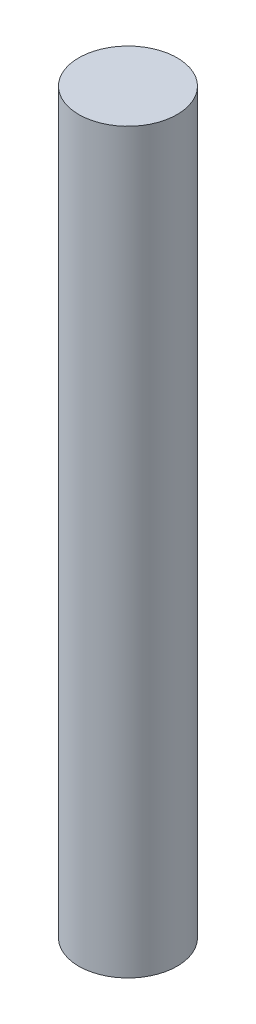
ISO-10303-21;
HEADER;
FILE_DESCRIPTION(('STEP AP214'),'2;1');
FILE_NAME('part.step','',(''),(''),'','','');
FILE_SCHEMA(('AUTOMOTIVE_DESIGN { 1 0 10303 214 1 1 1 1 }'));
ENDSEC;
DATA;
#1=APPLICATION_CONTEXT('core data for automotive mechanical design processes');
#2=APPLICATION_PROTOCOL_DEFINITION('international standard','automotive_design',2000,#1);
#3=PRODUCT_CONTEXT('',#1,'mechanical');
#4=PRODUCT('Part','Part','',(#3));
#5=PRODUCT_RELATED_PRODUCT_CATEGORY('part','',(#4));
#6=PRODUCT_DEFINITION_FORMATION('','',#4);
#7=PRODUCT_DEFINITION_CONTEXT('part definition',#1,'design');
#8=PRODUCT_DEFINITION('design','',#6,#7);
#9=PRODUCT_DEFINITION_SHAPE('','',#8);
#10=(LENGTH_UNIT() NAMED_UNIT(*) SI_UNIT(.MILLI.,.METRE.));
#11=(NAMED_UNIT(*) PLANE_ANGLE_UNIT() SI_UNIT($,.RADIAN.));
#12=(NAMED_UNIT(*) SI_UNIT($,.STERADIAN.) SOLID_ANGLE_UNIT());
#13=UNCERTAINTY_MEASURE_WITH_UNIT(LENGTH_MEASURE(1.E-05),#10,'distance_accuracy_value','');
#14=(GEOMETRIC_REPRESENTATION_CONTEXT(3) GLOBAL_UNCERTAINTY_ASSIGNED_CONTEXT((#13)) GLOBAL_UNIT_ASSIGNED_CONTEXT((#10,
#11,#12)) REPRESENTATION_CONTEXT('',''));
#15=CARTESIAN_POINT('',(0.,0.,0.));
#16=DIRECTION('',(0.,0.,1.));
#17=DIRECTION('',(1.,0.,0.));
#18=AXIS2_PLACEMENT_3D('',#15,#16,#17);
#19=CARTESIAN_POINT('',(0.,135.,0.));
#20=DIRECTION('',(0.,-1.,0.));
#21=DIRECTION('',(0.,0.,-1.));
#22=AXIS2_PLACEMENT_3D('',#19,#20,#21);
#23=CYLINDRICAL_SURFACE('',#22,9.);
#24=CARTESIAN_POINT('',(0.,135.,0.));
#25=DIRECTION('',(0.,1.,0.));
#26=DIRECTION('',(0.,0.,1.));
#27=AXIS2_PLACEMENT_3D('',#24,#25,#26);
#28=CIRCLE('',#27,9.);
#29=CARTESIAN_POINT('',(0.,135.,9.));
#30=VERTEX_POINT('',#29);
#31=EDGE_CURVE('E10',#30,#30,#28,.T.);
#32=ORIENTED_EDGE('',*,*,#31,.F.);
#33=EDGE_LOOP('',(#32));
#34=FACE_BOUND('',#33,.T.);
#35=CARTESIAN_POINT('',(0.,0.,0.));
#36=DIRECTION('',(0.,1.,0.));
#37=DIRECTION('',(0.,0.,1.));
#38=AXIS2_PLACEMENT_3D('',#35,#36,#37);
#39=CIRCLE('',#38,9.);
#40=CARTESIAN_POINT('',(0.,0.,9.));
#41=VERTEX_POINT('',#40);
#42=EDGE_CURVE('E40',#41,#41,#39,.T.);
#43=ORIENTED_EDGE('',*,*,#42,.T.);
#44=EDGE_LOOP('',(#43));
#45=FACE_BOUND('',#44,.T.);
#46=ADVANCED_FACE('F37',(#34,#45),#23,.T.);
#47=CARTESIAN_POINT('',(0.,135.,0.));
#48=DIRECTION('',(0.,1.,0.));
#49=DIRECTION('',(0.,0.,1.));
#50=AXIS2_PLACEMENT_3D('',#47,#48,#49);
#51=PLANE('',#50);
#52=ORIENTED_EDGE('',*,*,#31,.T.);
#53=EDGE_LOOP('',(#52));
#54=FACE_BOUND('',#53,.T.);
#55=ADVANCED_FACE('F54',(#54),#51,.T.);
#56=CARTESIAN_POINT('',(0.,0.,0.));
#57=DIRECTION('',(0.,1.,0.));
#58=DIRECTION('',(0.,0.,1.));
#59=AXIS2_PLACEMENT_3D('',#56,#57,#58);
#60=PLANE('',#59);
#61=ORIENTED_EDGE('',*,*,#42,.F.);
#62=EDGE_LOOP('',(#61));
#63=FACE_BOUND('',#62,.T.);
#64=ADVANCED_FACE('F52',(#63),#60,.F.);
#65=CLOSED_SHELL('',(#46,#55,#64));
#66=MANIFOLD_SOLID_BREP('B2',#65);
#67=ADVANCED_BREP_SHAPE_REPRESENTATION('',(#18,#66),#14);
#68=SHAPE_DEFINITION_REPRESENTATION(#9,#67);
ENDSEC;
END-ISO-10303-21;
